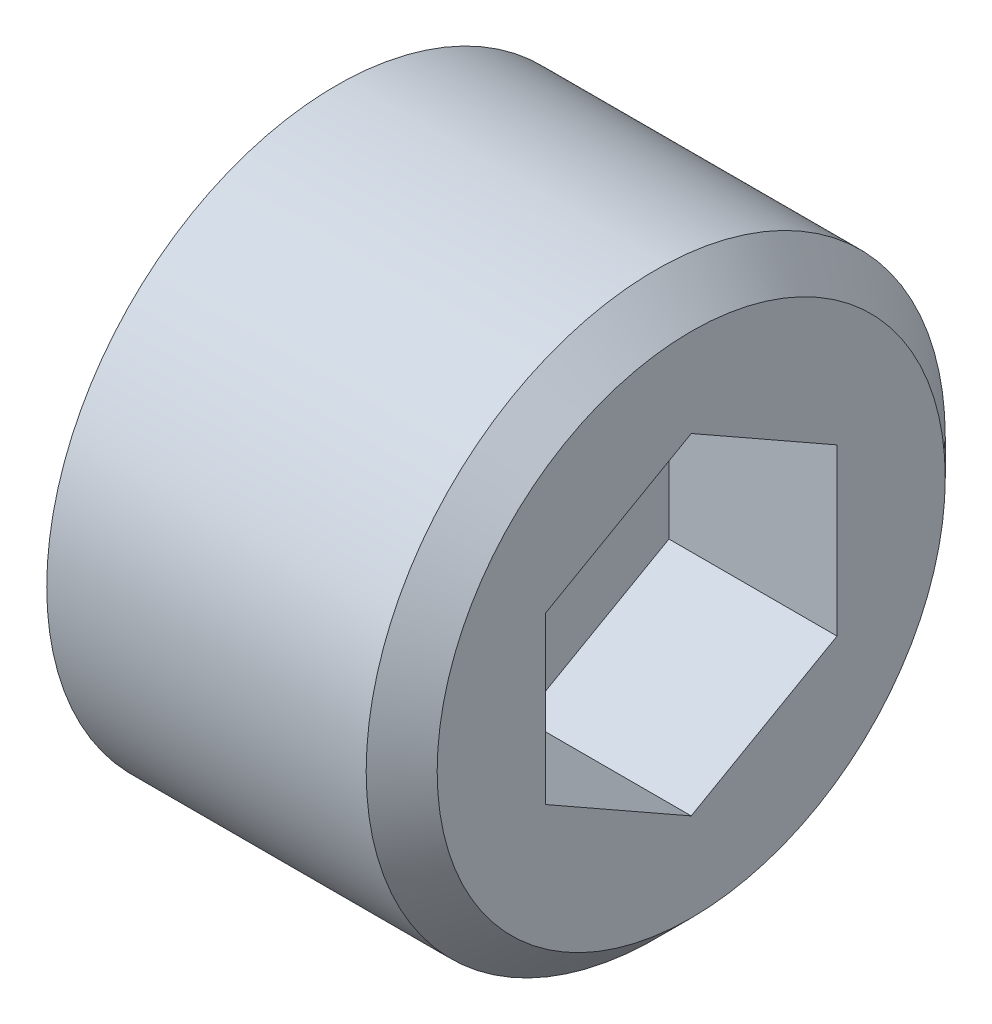
ISO-10303-21;
HEADER;
FILE_DESCRIPTION(('STEP AP214'),'2;1');
FILE_NAME('part.step','',(''),(''),'','','');
FILE_SCHEMA(('AUTOMOTIVE_DESIGN { 1 0 10303 214 1 1 1 1 }'));
ENDSEC;
DATA;
#1=APPLICATION_CONTEXT('core data for automotive mechanical design processes');
#2=APPLICATION_PROTOCOL_DEFINITION('international standard','automotive_design',2000,#1);
#3=PRODUCT_CONTEXT('',#1,'mechanical');
#4=PRODUCT('Part','Part','',(#3));
#5=PRODUCT_RELATED_PRODUCT_CATEGORY('part','',(#4));
#6=PRODUCT_DEFINITION_FORMATION('','',#4);
#7=PRODUCT_DEFINITION_CONTEXT('part definition',#1,'design');
#8=PRODUCT_DEFINITION('design','',#6,#7);
#9=PRODUCT_DEFINITION_SHAPE('','',#8);
#10=(LENGTH_UNIT() NAMED_UNIT(*) SI_UNIT(.MILLI.,.METRE.));
#11=(NAMED_UNIT(*) PLANE_ANGLE_UNIT() SI_UNIT($,.RADIAN.));
#12=(NAMED_UNIT(*) SI_UNIT($,.STERADIAN.) SOLID_ANGLE_UNIT());
#13=UNCERTAINTY_MEASURE_WITH_UNIT(LENGTH_MEASURE(1.E-05),#10,'distance_accuracy_value','');
#14=(GEOMETRIC_REPRESENTATION_CONTEXT(3) GLOBAL_UNCERTAINTY_ASSIGNED_CONTEXT((#13)) GLOBAL_UNIT_ASSIGNED_CONTEXT((#10,
#11,#12)) REPRESENTATION_CONTEXT('',''));
#15=CARTESIAN_POINT('',(0.,0.,0.));
#16=DIRECTION('',(0.,0.,1.));
#17=DIRECTION('',(1.,0.,0.));
#18=AXIS2_PLACEMENT_3D('',#15,#16,#17);
#19=CARTESIAN_POINT('',(698.265305948307,539.1641871,53.4669999999998));
#20=DIRECTION('',(1.,0.,0.));
#21=DIRECTION('',(0.,0.,-1.));
#22=AXIS2_PLACEMENT_3D('',#19,#20,#21);
#23=PLANE('',#22);
#24=DIRECTION('',(0.,0.493693899375207,0.869635747724128));
#25=VECTOR('',#24,1.);
#26=CARTESIAN_POINT('',(698.265305948307,540.289906050237,51.484059878083));
#27=LINE('',#26,#25);
#28=CARTESIAN_POINT('',(698.265305948307,540.289906050237,51.484059878083));
#29=VERTEX_POINT('',#28);
#30=CARTESIAN_POINT('',(698.265305948307,541.415625000473,53.4669999999997));
#31=VERTEX_POINT('',#30);
#32=EDGE_CURVE('E81',#29,#31,#27,.T.);
#33=ORIENTED_EDGE('',*,*,#32,.T.);
#34=DIRECTION('',(0.,-0.493693899375212,0.869635747724125));
#35=VECTOR('',#34,1.);
#36=CARTESIAN_POINT('',(698.265305948307,541.415625000473,53.4669999999998));
#37=LINE('',#36,#35);
#38=CARTESIAN_POINT('',(698.265305948307,540.289906050236,55.4499401219164));
#39=VERTEX_POINT('',#38);
#40=EDGE_CURVE('E65',#31,#39,#37,.T.);
#41=ORIENTED_EDGE('',*,*,#40,.T.);
#42=DIRECTION('',(0.,1.,0.));
#43=VECTOR('',#42,1.);
#44=CARTESIAN_POINT('',(698.265305948307,540.289906050237,55.4499401219165));
#45=LINE('',#44,#43);
#46=CARTESIAN_POINT('',(698.265305948307,538.038468149764,55.4499401219165));
#47=VERTEX_POINT('',#46);
#48=EDGE_CURVE('E70',#39,#47,#45,.F.);
#49=ORIENTED_EDGE('',*,*,#48,.T.);
#50=DIRECTION('',(0.,-0.493693899375212,-0.869635747724125));
#51=VECTOR('',#50,1.);
#52=CARTESIAN_POINT('',(698.265305948307,538.038468149764,55.4499401219165));
#53=LINE('',#52,#51);
#54=CARTESIAN_POINT('',(698.265305948307,536.912749199527,53.4669999999998));
#55=VERTEX_POINT('',#54);
#56=EDGE_CURVE('E104',#47,#55,#53,.T.);
#57=ORIENTED_EDGE('',*,*,#56,.T.);
#58=DIRECTION('',(0.,0.493693899375192,-0.869635747724136));
#59=VECTOR('',#58,1.);
#60=CARTESIAN_POINT('',(698.265305948307,536.912749199527,53.4669999999998));
#61=LINE('',#60,#59);
#62=CARTESIAN_POINT('',(698.265305948307,538.038468149764,51.4840598780831));
#63=VERTEX_POINT('',#62);
#64=EDGE_CURVE('E99',#55,#63,#61,.T.);
#65=ORIENTED_EDGE('',*,*,#64,.T.);
#66=DIRECTION('',(0.,1.,0.));
#67=VECTOR('',#66,1.);
#68=CARTESIAN_POINT('',(698.265305948307,538.038468149764,51.484059878083));
#69=LINE('',#68,#67);
#70=EDGE_CURVE('E95',#63,#29,#69,.T.);
#71=ORIENTED_EDGE('',*,*,#70,.T.);
#72=EDGE_LOOP('',(#33,#41,#49,#57,#65,#71));
#73=FACE_BOUND('',#72,.T.);
#74=ADVANCED_FACE('F16',(#73),#23,.T.);
#75=CARTESIAN_POINT('',(700.551305948307,540.289906050237,55.4499401219165));
#76=DIRECTION('',(0.,0.,1.));
#77=DIRECTION('',(1.,0.,0.));
#78=AXIS2_PLACEMENT_3D('',#75,#76,#77);
#79=PLANE('',#78);
#80=DIRECTION('',(1.,0.,0.));
#81=VECTOR('',#80,1.);
#82=CARTESIAN_POINT('',(700.551305948307,540.289906050236,55.4499401219163));
#83=LINE('',#82,#81);
#84=CARTESIAN_POINT('',(700.551305948307,540.289906050236,55.4499401219164));
#85=VERTEX_POINT('',#84);
#86=EDGE_CURVE('E72',#39,#85,#83,.T.);
#87=ORIENTED_EDGE('',*,*,#86,.T.);
#88=DIRECTION('',(0.,1.,0.));
#89=VECTOR('',#88,1.);
#90=CARTESIAN_POINT('',(700.551305948307,539.1641871,55.4499401219165));
#91=LINE('',#90,#89);
#92=CARTESIAN_POINT('',(700.551305948307,538.038468149764,55.4499401219165));
#93=VERTEX_POINT('',#92);
#94=EDGE_CURVE('E106',#93,#85,#91,.T.);
#95=ORIENTED_EDGE('',*,*,#94,.F.);
#96=DIRECTION('',(1.,0.,0.));
#97=VECTOR('',#96,1.);
#98=CARTESIAN_POINT('',(700.551305948307,538.038468149764,55.4499401219165));
#99=LINE('',#98,#97);
#100=EDGE_CURVE('E75',#93,#47,#99,.F.);
#101=ORIENTED_EDGE('',*,*,#100,.T.);
#102=ORIENTED_EDGE('',*,*,#48,.F.);
#103=EDGE_LOOP('',(#87,#95,#101,#102));
#104=FACE_BOUND('',#103,.T.);
#105=ADVANCED_FACE('F71',(#104),#79,.F.);
#106=CARTESIAN_POINT('',(700.551305948307,541.415625000473,53.4669999999998));
#107=DIRECTION('',(0.,0.869635747724125,0.493693899375212));
#108=DIRECTION('',(0.,-0.493693899375212,0.869635747724125));
#109=AXIS2_PLACEMENT_3D('',#106,#107,#108);
#110=PLANE('',#109);
#111=DIRECTION('',(1.,0.,0.));
#112=VECTOR('',#111,1.);
#113=CARTESIAN_POINT('',(700.551305948307,541.415625000474,53.4669999999995));
#114=LINE('',#113,#112);
#115=CARTESIAN_POINT('',(700.551305948307,541.415625000473,53.4669999999997));
#116=VERTEX_POINT('',#115);
#117=EDGE_CURVE('E83',#31,#116,#114,.T.);
#118=ORIENTED_EDGE('',*,*,#117,.T.);
#119=DIRECTION('',(0.,0.493693899375021,-0.869635747724233));
#120=VECTOR('',#119,1.);
#121=CARTESIAN_POINT('',(700.551305948307,540.289906050237,55.4499401219165));
#122=LINE('',#121,#120);
#123=EDGE_CURVE('E87',#85,#116,#122,.T.);
#124=ORIENTED_EDGE('',*,*,#123,.F.);
#125=ORIENTED_EDGE('',*,*,#86,.F.);
#126=ORIENTED_EDGE('',*,*,#40,.F.);
#127=EDGE_LOOP('',(#118,#124,#125,#126));
#128=FACE_BOUND('',#127,.T.);
#129=ADVANCED_FACE('F85',(#128),#110,.F.);
#130=CARTESIAN_POINT('',(700.551305948307,540.289906050237,51.484059878083));
#131=DIRECTION('',(0.,0.869635747724128,-0.493693899375207));
#132=DIRECTION('',(0.,0.493693899375207,0.869635747724128));
#133=AXIS2_PLACEMENT_3D('',#130,#131,#132);
#134=PLANE('',#133);
#135=DIRECTION('',(-1.,0.,0.));
#136=VECTOR('',#135,1.);
#137=CARTESIAN_POINT('',(700.551305948307,540.289906050237,51.484059878083));
#138=LINE('',#137,#136);
#139=CARTESIAN_POINT('',(700.551305948307,540.289906050237,51.484059878083));
#140=VERTEX_POINT('',#139);
#141=EDGE_CURVE('E93',#29,#140,#138,.F.);
#142=ORIENTED_EDGE('',*,*,#141,.T.);
#143=DIRECTION('',(0.,-0.493693899375018,-0.869635747724235));
#144=VECTOR('',#143,1.);
#145=CARTESIAN_POINT('',(700.551305948307,541.415625000473,53.4669999999998));
#146=LINE('',#145,#144);
#147=EDGE_CURVE('E109',#116,#140,#146,.T.);
#148=ORIENTED_EDGE('',*,*,#147,.F.);
#149=ORIENTED_EDGE('',*,*,#117,.F.);
#150=ORIENTED_EDGE('',*,*,#32,.F.);
#151=EDGE_LOOP('',(#142,#148,#149,#150));
#152=FACE_BOUND('',#151,.T.);
#153=ADVANCED_FACE('F191',(#152),#134,.F.);
#154=CARTESIAN_POINT('',(700.551305948307,538.038468149764,51.484059878083));
#155=DIRECTION('',(0.,0.,-1.));
#156=DIRECTION('',(-1.,0.,0.));
#157=AXIS2_PLACEMENT_3D('',#154,#155,#156);
#158=PLANE('',#157);
#159=DIRECTION('',(1.,0.,0.));
#160=VECTOR('',#159,1.);
#161=CARTESIAN_POINT('',(700.551305948307,538.038468149764,51.4840598780832));
#162=LINE('',#161,#160);
#163=CARTESIAN_POINT('',(700.551305948307,538.038468149764,51.4840598780831));
#164=VERTEX_POINT('',#163);
#165=EDGE_CURVE('E97',#63,#164,#162,.T.);
#166=ORIENTED_EDGE('',*,*,#165,.T.);
#167=DIRECTION('',(0.,1.,0.));
#168=VECTOR('',#167,1.);
#169=CARTESIAN_POINT('',(700.551305948307,539.1641871,51.484059878083));
#170=LINE('',#169,#168);
#171=EDGE_CURVE('E112',#140,#164,#170,.F.);
#172=ORIENTED_EDGE('',*,*,#171,.F.);
#173=ORIENTED_EDGE('',*,*,#141,.F.);
#174=ORIENTED_EDGE('',*,*,#70,.F.);
#175=EDGE_LOOP('',(#166,#172,#173,#174));
#176=FACE_BOUND('',#175,.T.);
#177=ADVANCED_FACE('F138',(#176),#158,.F.);
#178=CARTESIAN_POINT('',(700.551305948307,536.912749199527,53.4669999999998));
#179=DIRECTION('',(0.,-0.869635747724136,-0.493693899375192));
#180=DIRECTION('',(0.,0.493693899375192,-0.869635747724136));
#181=AXIS2_PLACEMENT_3D('',#178,#179,#180);
#182=PLANE('',#181);
#183=DIRECTION('',(1.,0.,0.));
#184=VECTOR('',#183,1.);
#185=CARTESIAN_POINT('',(700.551305948307,536.912749199527,53.467));
#186=LINE('',#185,#184);
#187=CARTESIAN_POINT('',(700.551305948307,536.912749199527,53.4669999999998));
#188=VERTEX_POINT('',#187);
#189=EDGE_CURVE('E33',#55,#188,#186,.T.);
#190=ORIENTED_EDGE('',*,*,#189,.T.);
#191=DIRECTION('',(0.,-0.493693899375018,0.869635747724235));
#192=VECTOR('',#191,1.);
#193=CARTESIAN_POINT('',(700.551305948307,538.038468149764,51.484059878083));
#194=LINE('',#193,#192);
#195=EDGE_CURVE('E115',#164,#188,#194,.T.);
#196=ORIENTED_EDGE('',*,*,#195,.F.);
#197=ORIENTED_EDGE('',*,*,#165,.F.);
#198=ORIENTED_EDGE('',*,*,#64,.F.);
#199=EDGE_LOOP('',(#190,#196,#197,#198));
#200=FACE_BOUND('',#199,.T.);
#201=ADVANCED_FACE('F136',(#200),#182,.F.);
#202=CARTESIAN_POINT('',(700.551305948307,538.038468149764,55.4499401219165));
#203=DIRECTION('',(0.,-0.869635747724125,0.493693899375212));
#204=DIRECTION('',(0.,-0.493693899375212,-0.869635747724125));
#205=AXIS2_PLACEMENT_3D('',#202,#203,#204);
#206=PLANE('',#205);
#207=ORIENTED_EDGE('',*,*,#100,.F.);
#208=DIRECTION('',(0.,0.493693899375021,0.869635747724233));
#209=VECTOR('',#208,1.);
#210=CARTESIAN_POINT('',(700.551305948307,536.912749199527,53.4669999999998));
#211=LINE('',#210,#209);
#212=EDGE_CURVE('E118',#188,#93,#211,.T.);
#213=ORIENTED_EDGE('',*,*,#212,.F.);
#214=ORIENTED_EDGE('',*,*,#189,.F.);
#215=ORIENTED_EDGE('',*,*,#56,.F.);
#216=EDGE_LOOP('',(#207,#213,#214,#215));
#217=FACE_BOUND('',#216,.T.);
#218=ADVANCED_FACE('F132',(#217),#206,.F.);
#219=CARTESIAN_POINT('',(700.551305948307,539.1641871,53.4669999999998));
#220=DIRECTION('',(1.,0.,0.));
#221=DIRECTION('',(0.,0.,-1.));
#222=AXIS2_PLACEMENT_3D('',#219,#220,#221);
#223=PLANE('',#222);
#224=CARTESIAN_POINT('',(700.551305948295,539.1641871,53.4669999999998));
#225=DIRECTION('',(-1.,0.,0.));
#226=DIRECTION('',(0.,0.,1.));
#227=AXIS2_PLACEMENT_3D('',#224,#225,#226);
#228=CIRCLE('',#227,3.45439999998221);
#229=CARTESIAN_POINT('',(700.551305948295,539.1641871,56.921399999982));
#230=VERTEX_POINT('',#229);
#231=EDGE_CURVE('E19',#230,#230,#228,.T.);
#232=ORIENTED_EDGE('',*,*,#231,.F.);
#233=EDGE_LOOP('',(#232));
#234=FACE_BOUND('',#233,.T.);
#235=ORIENTED_EDGE('',*,*,#195,.T.);
#236=ORIENTED_EDGE('',*,*,#212,.T.);
#237=ORIENTED_EDGE('',*,*,#94,.T.);
#238=ORIENTED_EDGE('',*,*,#123,.T.);
#239=ORIENTED_EDGE('',*,*,#147,.T.);
#240=ORIENTED_EDGE('',*,*,#171,.T.);
#241=EDGE_LOOP('',(#235,#236,#237,#238,#239,#240));
#242=FACE_BOUND('',#241,.T.);
#243=ADVANCED_FACE('F129',(#234,#242),#223,.T.);
#244=CARTESIAN_POINT('',(700.068705948411,539.1641871,53.4669999999998));
#245=DIRECTION('',(-1.,0.,0.));
#246=DIRECTION('',(0.,0.,1.));
#247=AXIS2_PLACEMENT_3D('',#244,#245,#246);
#248=CONICAL_SURFACE('',#247,3.93699999986652,0.785398163397448);
#249=CARTESIAN_POINT('',(700.068705948307,539.1641871,53.4669999999998));
#250=DIRECTION('',(1.,0.,0.));
#251=DIRECTION('',(0.,0.,-1.));
#252=AXIS2_PLACEMENT_3D('',#249,#250,#251);
#253=CIRCLE('',#252,3.937);
#254=CARTESIAN_POINT('',(700.068705948307,539.1641871,49.5299999999998));
#255=VERTEX_POINT('',#254);
#256=EDGE_CURVE('E25',#255,#255,#253,.F.);
#257=ORIENTED_EDGE('',*,*,#256,.F.);
#258=EDGE_LOOP('',(#257));
#259=FACE_BOUND('',#258,.T.);
#260=ORIENTED_EDGE('',*,*,#231,.T.);
#261=EDGE_LOOP('',(#260));
#262=FACE_BOUND('',#261,.T.);
#263=ADVANCED_FACE('F127',(#259,#262),#248,.T.);
#264=CARTESIAN_POINT('',(695.725305948307,539.1641871,53.4669999999998));
#265=DIRECTION('',(1.,0.,0.));
#266=DIRECTION('',(0.,0.,-1.));
#267=AXIS2_PLACEMENT_3D('',#264,#265,#266);
#268=PLANE('',#267);
#269=CARTESIAN_POINT('',(695.725305948307,539.1641871,53.4669999999998));
#270=DIRECTION('',(1.,0.,0.));
#271=DIRECTION('',(0.,0.,-1.));
#272=AXIS2_PLACEMENT_3D('',#269,#270,#271);
#273=CIRCLE('',#272,3.937);
#274=CARTESIAN_POINT('',(695.725305948307,539.1641871,49.5299999999998));
#275=VERTEX_POINT('',#274);
#276=EDGE_CURVE('E11',#275,#275,#273,.T.);
#277=ORIENTED_EDGE('',*,*,#276,.F.);
#278=EDGE_LOOP('',(#277));
#279=FACE_BOUND('',#278,.T.);
#280=ADVANCED_FACE('F150',(#279),#268,.F.);
#281=CARTESIAN_POINT('',(700.551305948307,539.1641871,53.4669999999998));
#282=DIRECTION('',(1.,0.,0.));
#283=DIRECTION('',(0.,0.,-1.));
#284=AXIS2_PLACEMENT_3D('',#281,#282,#283);
#285=CYLINDRICAL_SURFACE('',#284,3.937);
#286=ORIENTED_EDGE('',*,*,#256,.T.);
#287=EDGE_LOOP('',(#286));
#288=FACE_BOUND('',#287,.T.);
#289=ORIENTED_EDGE('',*,*,#276,.T.);
#290=EDGE_LOOP('',(#289));
#291=FACE_BOUND('',#290,.T.);
#292=ADVANCED_FACE('F148',(#288,#291),#285,.T.);
#293=CLOSED_SHELL('',(#74,#105,#129,#153,#177,#201,#218,#243,#263,#280,#292));
#294=MANIFOLD_SOLID_BREP('B1',#293);
#295=ADVANCED_BREP_SHAPE_REPRESENTATION('',(#18,#294),#14);
#296=SHAPE_DEFINITION_REPRESENTATION(#9,#295);
ENDSEC;
END-ISO-10303-21;
